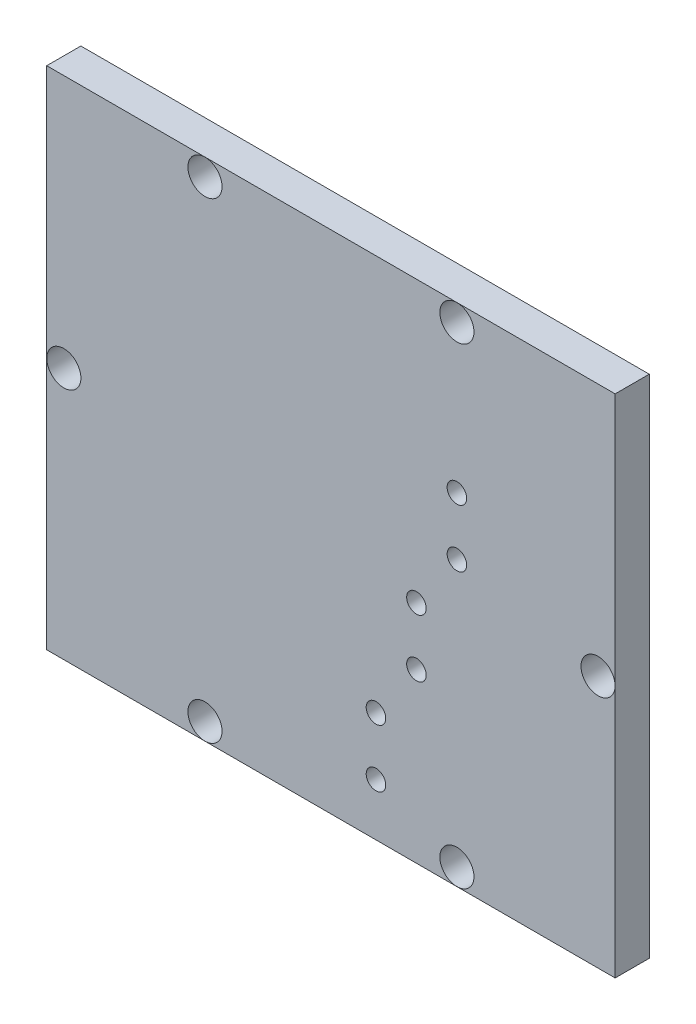
ISO-10303-21;
HEADER;
FILE_DESCRIPTION(('STEP AP214'),'2;1');
FILE_NAME('part.step','',(''),(''),'','','');
FILE_SCHEMA(('AUTOMOTIVE_DESIGN { 1 0 10303 214 1 1 1 1 }'));
ENDSEC;
DATA;
#1=APPLICATION_CONTEXT('core data for automotive mechanical design processes');
#2=APPLICATION_PROTOCOL_DEFINITION('international standard','automotive_design',2000,#1);
#3=PRODUCT_CONTEXT('',#1,'mechanical');
#4=PRODUCT('Part','Part','',(#3));
#5=PRODUCT_RELATED_PRODUCT_CATEGORY('part','',(#4));
#6=PRODUCT_DEFINITION_FORMATION('','',#4);
#7=PRODUCT_DEFINITION_CONTEXT('part definition',#1,'design');
#8=PRODUCT_DEFINITION('design','',#6,#7);
#9=PRODUCT_DEFINITION_SHAPE('','',#8);
#10=(LENGTH_UNIT() NAMED_UNIT(*) SI_UNIT(.MILLI.,.METRE.));
#11=(NAMED_UNIT(*) PLANE_ANGLE_UNIT() SI_UNIT($,.RADIAN.));
#12=(NAMED_UNIT(*) SI_UNIT($,.STERADIAN.) SOLID_ANGLE_UNIT());
#13=UNCERTAINTY_MEASURE_WITH_UNIT(LENGTH_MEASURE(1.E-05),#10,'distance_accuracy_value','');
#14=(GEOMETRIC_REPRESENTATION_CONTEXT(3) GLOBAL_UNCERTAINTY_ASSIGNED_CONTEXT((#13)) GLOBAL_UNIT_ASSIGNED_CONTEXT((#10,
#11,#12)) REPRESENTATION_CONTEXT('',''));
#15=CARTESIAN_POINT('',(0.,0.,0.));
#16=DIRECTION('',(0.,0.,1.));
#17=DIRECTION('',(1.,0.,0.));
#18=AXIS2_PLACEMENT_3D('',#15,#16,#17);
#19=CARTESIAN_POINT('',(158.75,0.,9.525));
#20=DIRECTION('',(0.,1.,0.));
#21=DIRECTION('',(-1.,0.,0.));
#22=AXIS2_PLACEMENT_3D('',#19,#20,#21);
#23=PLANE('',#22);
#24=DIRECTION('',(1.,0.,0.));
#25=VECTOR('',#24,1.);
#26=CARTESIAN_POINT('',(158.75,0.,0.));
#27=LINE('',#26,#25);
#28=CARTESIAN_POINT('',(0.,0.,0.));
#29=VERTEX_POINT('',#28);
#30=CARTESIAN_POINT('',(158.75,0.,0.));
#31=VERTEX_POINT('',#30);
#32=EDGE_CURVE('E95',#29,#31,#27,.T.);
#33=ORIENTED_EDGE('',*,*,#32,.T.);
#34=DIRECTION('',(0.,0.,-1.));
#35=VECTOR('',#34,1.);
#36=CARTESIAN_POINT('',(158.75,0.,9.525));
#37=LINE('',#36,#35);
#38=CARTESIAN_POINT('',(158.75,0.,9.525));
#39=VERTEX_POINT('',#38);
#40=EDGE_CURVE('E11',#39,#31,#37,.T.);
#41=ORIENTED_EDGE('',*,*,#40,.F.);
#42=DIRECTION('',(1.,0.,0.));
#43=VECTOR('',#42,1.);
#44=CARTESIAN_POINT('',(158.75,0.,9.525));
#45=LINE('',#44,#43);
#46=CARTESIAN_POINT('',(0.,0.,9.525));
#47=VERTEX_POINT('',#46);
#48=EDGE_CURVE('E83',#47,#39,#45,.T.);
#49=ORIENTED_EDGE('',*,*,#48,.F.);
#50=DIRECTION('',(0.,0.,-1.));
#51=VECTOR('',#50,1.);
#52=CARTESIAN_POINT('',(0.,0.,9.525));
#53=LINE('',#52,#51);
#54=EDGE_CURVE('E91',#47,#29,#53,.T.);
#55=ORIENTED_EDGE('',*,*,#54,.T.);
#56=EDGE_LOOP('',(#33,#41,#49,#55));
#57=FACE_BOUND('',#56,.T.);
#58=ADVANCED_FACE('F32',(#57),#23,.F.);
#59=CARTESIAN_POINT('',(158.75,141.2875,9.525));
#60=DIRECTION('',(-1.,0.,0.));
#61=DIRECTION('',(0.,0.,1.));
#62=AXIS2_PLACEMENT_3D('',#59,#60,#61);
#63=PLANE('',#62);
#64=DIRECTION('',(0.,1.,0.));
#65=VECTOR('',#64,1.);
#66=CARTESIAN_POINT('',(158.75,141.2875,0.));
#67=LINE('',#66,#65);
#68=CARTESIAN_POINT('',(158.75,141.2875,0.));
#69=VERTEX_POINT('',#68);
#70=EDGE_CURVE('E87',#31,#69,#67,.T.);
#71=ORIENTED_EDGE('',*,*,#70,.T.);
#72=DIRECTION('',(0.,0.,-1.));
#73=VECTOR('',#72,1.);
#74=CARTESIAN_POINT('',(158.75,141.2875,9.525));
#75=LINE('',#74,#73);
#76=CARTESIAN_POINT('',(158.75,141.2875,9.525));
#77=VERTEX_POINT('',#76);
#78=EDGE_CURVE('E40',#77,#69,#75,.T.);
#79=ORIENTED_EDGE('',*,*,#78,.F.);
#80=DIRECTION('',(0.,1.,0.));
#81=VECTOR('',#80,1.);
#82=CARTESIAN_POINT('',(158.75,141.2875,9.525));
#83=LINE('',#82,#81);
#84=EDGE_CURVE('E78',#39,#77,#83,.T.);
#85=ORIENTED_EDGE('',*,*,#84,.F.);
#86=ORIENTED_EDGE('',*,*,#40,.T.);
#87=EDGE_LOOP('',(#71,#79,#85,#86));
#88=FACE_BOUND('',#87,.T.);
#89=ADVANCED_FACE('F86',(#88),#63,.F.);
#90=CARTESIAN_POINT('',(0.,141.2875,9.525));
#91=DIRECTION('',(0.,-1.,0.));
#92=DIRECTION('',(0.,0.,-1.));
#93=AXIS2_PLACEMENT_3D('',#90,#91,#92);
#94=PLANE('',#93);
#95=DIRECTION('',(-1.,0.,0.));
#96=VECTOR('',#95,1.);
#97=CARTESIAN_POINT('',(0.,141.2875,0.));
#98=LINE('',#97,#96);
#99=CARTESIAN_POINT('',(0.,141.2875,0.));
#100=VERTEX_POINT('',#99);
#101=EDGE_CURVE('E65',#69,#100,#98,.T.);
#102=ORIENTED_EDGE('',*,*,#101,.T.);
#103=DIRECTION('',(0.,0.,-1.));
#104=VECTOR('',#103,1.);
#105=CARTESIAN_POINT('',(0.,141.2875,9.525));
#106=LINE('',#105,#104);
#107=CARTESIAN_POINT('',(0.,141.2875,9.525));
#108=VERTEX_POINT('',#107);
#109=EDGE_CURVE('E88',#108,#100,#106,.T.);
#110=ORIENTED_EDGE('',*,*,#109,.F.);
#111=DIRECTION('',(-1.,0.,0.));
#112=VECTOR('',#111,1.);
#113=CARTESIAN_POINT('',(0.,141.2875,9.525));
#114=LINE('',#113,#112);
#115=EDGE_CURVE('E81',#77,#108,#114,.T.);
#116=ORIENTED_EDGE('',*,*,#115,.F.);
#117=ORIENTED_EDGE('',*,*,#78,.T.);
#118=EDGE_LOOP('',(#102,#110,#116,#117));
#119=FACE_BOUND('',#118,.T.);
#120=ADVANCED_FACE('F89',(#119),#94,.F.);
#121=CARTESIAN_POINT('',(0.,0.,9.525));
#122=DIRECTION('',(1.,0.,0.));
#123=DIRECTION('',(0.,0.,-1.));
#124=AXIS2_PLACEMENT_3D('',#121,#122,#123);
#125=PLANE('',#124);
#126=DIRECTION('',(0.,-1.,0.));
#127=VECTOR('',#126,1.);
#128=CARTESIAN_POINT('',(0.,0.,0.));
#129=LINE('',#128,#127);
#130=EDGE_CURVE('E71',#100,#29,#129,.T.);
#131=ORIENTED_EDGE('',*,*,#130,.T.);
#132=ORIENTED_EDGE('',*,*,#54,.F.);
#133=DIRECTION('',(0.,-1.,0.));
#134=VECTOR('',#133,1.);
#135=CARTESIAN_POINT('',(0.,0.,9.525));
#136=LINE('',#135,#134);
#137=EDGE_CURVE('E48',#108,#47,#136,.T.);
#138=ORIENTED_EDGE('',*,*,#137,.F.);
#139=ORIENTED_EDGE('',*,*,#109,.T.);
#140=EDGE_LOOP('',(#131,#132,#138,#139));
#141=FACE_BOUND('',#140,.T.);
#142=ADVANCED_FACE('F103',(#141),#125,.F.);
#143=CARTESIAN_POINT('',(0.,0.,9.525));
#144=DIRECTION('',(0.,0.,-1.));
#145=DIRECTION('',(-1.,0.,0.));
#146=AXIS2_PLACEMENT_3D('',#143,#144,#145);
#147=PLANE('',#146);
#148=CARTESIAN_POINT('',(114.554,95.25,9.525));
#149=DIRECTION('',(0.,0.,1.));
#150=DIRECTION('',(1.,0.,0.));
#151=AXIS2_PLACEMENT_3D('',#148,#149,#150);
#152=CIRCLE('',#151,2.7305);
#153=CARTESIAN_POINT('',(117.2845,95.25,9.525));
#154=VERTEX_POINT('',#153);
#155=EDGE_CURVE('E175',#154,#154,#152,.T.);
#156=ORIENTED_EDGE('',*,*,#155,.F.);
#157=EDGE_LOOP('',(#156));
#158=FACE_BOUND('',#157,.T.);
#159=CARTESIAN_POINT('',(114.554,79.121,9.525));
#160=DIRECTION('',(0.,0.,1.));
#161=DIRECTION('',(1.,0.,0.));
#162=AXIS2_PLACEMENT_3D('',#159,#160,#161);
#163=CIRCLE('',#162,2.7305);
#164=CARTESIAN_POINT('',(117.2845,79.121,9.525));
#165=VERTEX_POINT('',#164);
#166=EDGE_CURVE('E169',#165,#165,#163,.T.);
#167=ORIENTED_EDGE('',*,*,#166,.F.);
#168=EDGE_LOOP('',(#167));
#169=FACE_BOUND('',#168,.T.);
#170=CARTESIAN_POINT('',(103.251,62.992,9.525));
#171=DIRECTION('',(0.,0.,1.));
#172=DIRECTION('',(1.,0.,0.));
#173=AXIS2_PLACEMENT_3D('',#170,#171,#172);
#174=CIRCLE('',#173,2.73050000000002);
#175=CARTESIAN_POINT('',(105.9815,62.992,9.525));
#176=VERTEX_POINT('',#175);
#177=EDGE_CURVE('E163',#176,#176,#174,.T.);
#178=ORIENTED_EDGE('',*,*,#177,.F.);
#179=EDGE_LOOP('',(#178));
#180=FACE_BOUND('',#179,.T.);
#181=CARTESIAN_POINT('',(103.251,46.863,9.525));
#182=DIRECTION('',(0.,0.,1.));
#183=DIRECTION('',(1.,0.,0.));
#184=AXIS2_PLACEMENT_3D('',#181,#182,#183);
#185=CIRCLE('',#184,2.7305);
#186=CARTESIAN_POINT('',(105.9815,46.863,9.525));
#187=VERTEX_POINT('',#186);
#188=EDGE_CURVE('E157',#187,#187,#185,.T.);
#189=ORIENTED_EDGE('',*,*,#188,.F.);
#190=EDGE_LOOP('',(#189));
#191=FACE_BOUND('',#190,.T.);
#192=CARTESIAN_POINT('',(91.948,30.734,9.525));
#193=DIRECTION('',(0.,0.,1.));
#194=DIRECTION('',(1.,0.,0.));
#195=AXIS2_PLACEMENT_3D('',#192,#193,#194);
#196=CIRCLE('',#195,2.7305);
#197=CARTESIAN_POINT('',(94.6785,30.734,9.525));
#198=VERTEX_POINT('',#197);
#199=EDGE_CURVE('E151',#198,#198,#196,.T.);
#200=ORIENTED_EDGE('',*,*,#199,.F.);
#201=EDGE_LOOP('',(#200));
#202=FACE_BOUND('',#201,.T.);
#203=CARTESIAN_POINT('',(91.948,14.605,9.525));
#204=DIRECTION('',(0.,0.,1.));
#205=DIRECTION('',(1.,0.,0.));
#206=AXIS2_PLACEMENT_3D('',#203,#204,#205);
#207=CIRCLE('',#206,2.7305);
#208=CARTESIAN_POINT('',(94.6785,14.605,9.525));
#209=VERTEX_POINT('',#208);
#210=EDGE_CURVE('E145',#209,#209,#207,.T.);
#211=ORIENTED_EDGE('',*,*,#210,.F.);
#212=EDGE_LOOP('',(#211));
#213=FACE_BOUND('',#212,.T.);
#214=CARTESIAN_POINT('',(114.554,4.7752,9.525));
#215=DIRECTION('',(0.,0.,1.));
#216=DIRECTION('',(1.,0.,0.));
#217=AXIS2_PLACEMENT_3D('',#214,#215,#216);
#218=CIRCLE('',#217,4.7625);
#219=CARTESIAN_POINT('',(119.3165,4.7752,9.525));
#220=VERTEX_POINT('',#219);
#221=EDGE_CURVE('E139',#220,#220,#218,.T.);
#222=ORIENTED_EDGE('',*,*,#221,.F.);
#223=EDGE_LOOP('',(#222));
#224=FACE_BOUND('',#223,.T.);
#225=CARTESIAN_POINT('',(44.196,4.7752,9.525));
#226=DIRECTION('',(0.,0.,1.));
#227=DIRECTION('',(1.,0.,0.));
#228=AXIS2_PLACEMENT_3D('',#225,#226,#227);
#229=CIRCLE('',#228,4.7625);
#230=CARTESIAN_POINT('',(48.9585,4.7752,9.525));
#231=VERTEX_POINT('',#230);
#232=EDGE_CURVE('E133',#231,#231,#229,.T.);
#233=ORIENTED_EDGE('',*,*,#232,.F.);
#234=EDGE_LOOP('',(#233));
#235=FACE_BOUND('',#234,.T.);
#236=CARTESIAN_POINT('',(114.554,136.5123,9.525));
#237=DIRECTION('',(0.,0.,1.));
#238=DIRECTION('',(1.,0.,0.));
#239=AXIS2_PLACEMENT_3D('',#236,#237,#238);
#240=CIRCLE('',#239,4.7625);
#241=CARTESIAN_POINT('',(119.3165,136.5123,9.525));
#242=VERTEX_POINT('',#241);
#243=EDGE_CURVE('E127',#242,#242,#240,.T.);
#244=ORIENTED_EDGE('',*,*,#243,.F.);
#245=EDGE_LOOP('',(#244));
#246=FACE_BOUND('',#245,.T.);
#247=CARTESIAN_POINT('',(44.196,136.5123,9.525));
#248=DIRECTION('',(0.,0.,1.));
#249=DIRECTION('',(1.,0.,0.));
#250=AXIS2_PLACEMENT_3D('',#247,#248,#249);
#251=CIRCLE('',#250,4.7625);
#252=CARTESIAN_POINT('',(48.9585,136.5123,9.525));
#253=VERTEX_POINT('',#252);
#254=EDGE_CURVE('E121',#253,#253,#251,.T.);
#255=ORIENTED_EDGE('',*,*,#254,.F.);
#256=EDGE_LOOP('',(#255));
#257=FACE_BOUND('',#256,.T.);
#258=CARTESIAN_POINT('',(153.9748,70.64375,9.525));
#259=DIRECTION('',(0.,0.,1.));
#260=DIRECTION('',(1.,0.,0.));
#261=AXIS2_PLACEMENT_3D('',#258,#259,#260);
#262=CIRCLE('',#261,4.76250000000001);
#263=CARTESIAN_POINT('',(158.7373,70.64375,9.525));
#264=VERTEX_POINT('',#263);
#265=EDGE_CURVE('E115',#264,#264,#262,.T.);
#266=ORIENTED_EDGE('',*,*,#265,.F.);
#267=EDGE_LOOP('',(#266));
#268=FACE_BOUND('',#267,.T.);
#269=CARTESIAN_POINT('',(4.7752,70.5036045316736,9.525));
#270=DIRECTION('',(0.,0.,1.));
#271=DIRECTION('',(1.,0.,0.));
#272=AXIS2_PLACEMENT_3D('',#269,#270,#271);
#273=CIRCLE('',#272,4.7625);
#274=CARTESIAN_POINT('',(9.5377,70.5036045316736,9.525));
#275=VERTEX_POINT('',#274);
#276=EDGE_CURVE('E109',#275,#275,#273,.T.);
#277=ORIENTED_EDGE('',*,*,#276,.F.);
#278=EDGE_LOOP('',(#277));
#279=FACE_BOUND('',#278,.T.);
#280=ORIENTED_EDGE('',*,*,#48,.T.);
#281=ORIENTED_EDGE('',*,*,#84,.T.);
#282=ORIENTED_EDGE('',*,*,#115,.T.);
#283=ORIENTED_EDGE('',*,*,#137,.T.);
#284=EDGE_LOOP('',(#280,#281,#282,#283));
#285=FACE_BOUND('',#284,.T.);
#286=ADVANCED_FACE('F79',(#158,#169,#180,#191,#202,#213,#224,#235,#246,#257,#268,#279,#285),
#147,.F.);
#287=CARTESIAN_POINT('',(0.,0.,0.));
#288=DIRECTION('',(0.,0.,-1.));
#289=DIRECTION('',(-1.,0.,0.));
#290=AXIS2_PLACEMENT_3D('',#287,#288,#289);
#291=PLANE('',#290);
#292=CARTESIAN_POINT('',(114.554,95.25,0.));
#293=DIRECTION('',(0.,0.,1.));
#294=DIRECTION('',(1.,0.,0.));
#295=AXIS2_PLACEMENT_3D('',#292,#293,#294);
#296=CIRCLE('',#295,2.7305);
#297=CARTESIAN_POINT('',(117.2845,95.25,0.));
#298=VERTEX_POINT('',#297);
#299=EDGE_CURVE('E172',#298,#298,#296,.T.);
#300=ORIENTED_EDGE('',*,*,#299,.T.);
#301=EDGE_LOOP('',(#300));
#302=FACE_BOUND('',#301,.T.);
#303=CARTESIAN_POINT('',(114.554,79.121,0.));
#304=DIRECTION('',(0.,0.,1.));
#305=DIRECTION('',(1.,0.,0.));
#306=AXIS2_PLACEMENT_3D('',#303,#304,#305);
#307=CIRCLE('',#306,2.7305);
#308=CARTESIAN_POINT('',(117.2845,79.121,0.));
#309=VERTEX_POINT('',#308);
#310=EDGE_CURVE('E166',#309,#309,#307,.T.);
#311=ORIENTED_EDGE('',*,*,#310,.T.);
#312=EDGE_LOOP('',(#311));
#313=FACE_BOUND('',#312,.T.);
#314=CARTESIAN_POINT('',(103.251,62.992,0.));
#315=DIRECTION('',(0.,0.,1.));
#316=DIRECTION('',(1.,0.,0.));
#317=AXIS2_PLACEMENT_3D('',#314,#315,#316);
#318=CIRCLE('',#317,2.73050000000002);
#319=CARTESIAN_POINT('',(105.9815,62.992,0.));
#320=VERTEX_POINT('',#319);
#321=EDGE_CURVE('E160',#320,#320,#318,.T.);
#322=ORIENTED_EDGE('',*,*,#321,.T.);
#323=EDGE_LOOP('',(#322));
#324=FACE_BOUND('',#323,.T.);
#325=CARTESIAN_POINT('',(103.251,46.863,0.));
#326=DIRECTION('',(0.,0.,1.));
#327=DIRECTION('',(1.,0.,0.));
#328=AXIS2_PLACEMENT_3D('',#325,#326,#327);
#329=CIRCLE('',#328,2.7305);
#330=CARTESIAN_POINT('',(105.9815,46.863,0.));
#331=VERTEX_POINT('',#330);
#332=EDGE_CURVE('E154',#331,#331,#329,.T.);
#333=ORIENTED_EDGE('',*,*,#332,.T.);
#334=EDGE_LOOP('',(#333));
#335=FACE_BOUND('',#334,.T.);
#336=CARTESIAN_POINT('',(91.948,30.734,0.));
#337=DIRECTION('',(0.,0.,1.));
#338=DIRECTION('',(1.,0.,0.));
#339=AXIS2_PLACEMENT_3D('',#336,#337,#338);
#340=CIRCLE('',#339,2.7305);
#341=CARTESIAN_POINT('',(94.6785,30.734,0.));
#342=VERTEX_POINT('',#341);
#343=EDGE_CURVE('E148',#342,#342,#340,.T.);
#344=ORIENTED_EDGE('',*,*,#343,.T.);
#345=EDGE_LOOP('',(#344));
#346=FACE_BOUND('',#345,.T.);
#347=CARTESIAN_POINT('',(91.948,14.605,0.));
#348=DIRECTION('',(0.,0.,1.));
#349=DIRECTION('',(1.,0.,0.));
#350=AXIS2_PLACEMENT_3D('',#347,#348,#349);
#351=CIRCLE('',#350,2.7305);
#352=CARTESIAN_POINT('',(94.6785,14.605,0.));
#353=VERTEX_POINT('',#352);
#354=EDGE_CURVE('E142',#353,#353,#351,.T.);
#355=ORIENTED_EDGE('',*,*,#354,.T.);
#356=EDGE_LOOP('',(#355));
#357=FACE_BOUND('',#356,.T.);
#358=CARTESIAN_POINT('',(114.554,4.7752,0.));
#359=DIRECTION('',(0.,0.,1.));
#360=DIRECTION('',(1.,0.,0.));
#361=AXIS2_PLACEMENT_3D('',#358,#359,#360);
#362=CIRCLE('',#361,4.7625);
#363=CARTESIAN_POINT('',(119.3165,4.7752,0.));
#364=VERTEX_POINT('',#363);
#365=EDGE_CURVE('E136',#364,#364,#362,.T.);
#366=ORIENTED_EDGE('',*,*,#365,.T.);
#367=EDGE_LOOP('',(#366));
#368=FACE_BOUND('',#367,.T.);
#369=CARTESIAN_POINT('',(44.196,4.7752,0.));
#370=DIRECTION('',(0.,0.,1.));
#371=DIRECTION('',(1.,0.,0.));
#372=AXIS2_PLACEMENT_3D('',#369,#370,#371);
#373=CIRCLE('',#372,4.7625);
#374=CARTESIAN_POINT('',(48.9585,4.7752,0.));
#375=VERTEX_POINT('',#374);
#376=EDGE_CURVE('E130',#375,#375,#373,.T.);
#377=ORIENTED_EDGE('',*,*,#376,.T.);
#378=EDGE_LOOP('',(#377));
#379=FACE_BOUND('',#378,.T.);
#380=CARTESIAN_POINT('',(114.554,136.5123,0.));
#381=DIRECTION('',(0.,0.,1.));
#382=DIRECTION('',(1.,0.,0.));
#383=AXIS2_PLACEMENT_3D('',#380,#381,#382);
#384=CIRCLE('',#383,4.7625);
#385=CARTESIAN_POINT('',(119.3165,136.5123,0.));
#386=VERTEX_POINT('',#385);
#387=EDGE_CURVE('E124',#386,#386,#384,.T.);
#388=ORIENTED_EDGE('',*,*,#387,.T.);
#389=EDGE_LOOP('',(#388));
#390=FACE_BOUND('',#389,.T.);
#391=CARTESIAN_POINT('',(44.196,136.5123,0.));
#392=DIRECTION('',(0.,0.,1.));
#393=DIRECTION('',(1.,0.,0.));
#394=AXIS2_PLACEMENT_3D('',#391,#392,#393);
#395=CIRCLE('',#394,4.7625);
#396=CARTESIAN_POINT('',(48.9585,136.5123,0.));
#397=VERTEX_POINT('',#396);
#398=EDGE_CURVE('E118',#397,#397,#395,.T.);
#399=ORIENTED_EDGE('',*,*,#398,.T.);
#400=EDGE_LOOP('',(#399));
#401=FACE_BOUND('',#400,.T.);
#402=CARTESIAN_POINT('',(153.9748,70.64375,0.));
#403=DIRECTION('',(0.,0.,1.));
#404=DIRECTION('',(1.,0.,0.));
#405=AXIS2_PLACEMENT_3D('',#402,#403,#404);
#406=CIRCLE('',#405,4.76250000000001);
#407=CARTESIAN_POINT('',(158.7373,70.64375,0.));
#408=VERTEX_POINT('',#407);
#409=EDGE_CURVE('E112',#408,#408,#406,.T.);
#410=ORIENTED_EDGE('',*,*,#409,.T.);
#411=EDGE_LOOP('',(#410));
#412=FACE_BOUND('',#411,.T.);
#413=CARTESIAN_POINT('',(4.7752,70.5036045316736,0.));
#414=DIRECTION('',(0.,0.,1.));
#415=DIRECTION('',(1.,0.,0.));
#416=AXIS2_PLACEMENT_3D('',#413,#414,#415);
#417=CIRCLE('',#416,4.7625);
#418=CARTESIAN_POINT('',(9.5377,70.5036045316736,0.));
#419=VERTEX_POINT('',#418);
#420=EDGE_CURVE('E98',#419,#419,#417,.T.);
#421=ORIENTED_EDGE('',*,*,#420,.T.);
#422=EDGE_LOOP('',(#421));
#423=FACE_BOUND('',#422,.T.);
#424=ORIENTED_EDGE('',*,*,#32,.F.);
#425=ORIENTED_EDGE('',*,*,#130,.F.);
#426=ORIENTED_EDGE('',*,*,#101,.F.);
#427=ORIENTED_EDGE('',*,*,#70,.F.);
#428=EDGE_LOOP('',(#424,#425,#426,#427));
#429=FACE_BOUND('',#428,.T.);
#430=ADVANCED_FACE('F106',(#302,#313,#324,#335,#346,#357,#368,#379,#390,#401,#412,#423,#429),
#291,.T.);
#431=CARTESIAN_POINT('',(4.7752,70.5036045316736,0.));
#432=DIRECTION('',(0.,0.,1.));
#433=DIRECTION('',(1.,0.,0.));
#434=AXIS2_PLACEMENT_3D('',#431,#432,#433);
#435=CYLINDRICAL_SURFACE('',#434,4.7625);
#436=ORIENTED_EDGE('',*,*,#420,.F.);
#437=EDGE_LOOP('',(#436));
#438=FACE_BOUND('',#437,.T.);
#439=ORIENTED_EDGE('',*,*,#276,.T.);
#440=EDGE_LOOP('',(#439));
#441=FACE_BOUND('',#440,.T.);
#442=ADVANCED_FACE('F215',(#438,#441),#435,.F.);
#443=CARTESIAN_POINT('',(153.9748,70.64375,0.));
#444=DIRECTION('',(0.,0.,1.));
#445=DIRECTION('',(1.,0.,0.));
#446=AXIS2_PLACEMENT_3D('',#443,#444,#445);
#447=CYLINDRICAL_SURFACE('',#446,4.76250000000001);
#448=ORIENTED_EDGE('',*,*,#409,.F.);
#449=EDGE_LOOP('',(#448));
#450=FACE_BOUND('',#449,.T.);
#451=ORIENTED_EDGE('',*,*,#265,.T.);
#452=EDGE_LOOP('',(#451));
#453=FACE_BOUND('',#452,.T.);
#454=ADVANCED_FACE('F217',(#450,#453),#447,.F.);
#455=CARTESIAN_POINT('',(44.196,136.5123,0.));
#456=DIRECTION('',(0.,0.,1.));
#457=DIRECTION('',(1.,0.,0.));
#458=AXIS2_PLACEMENT_3D('',#455,#456,#457);
#459=CYLINDRICAL_SURFACE('',#458,4.7625);
#460=ORIENTED_EDGE('',*,*,#398,.F.);
#461=EDGE_LOOP('',(#460));
#462=FACE_BOUND('',#461,.T.);
#463=ORIENTED_EDGE('',*,*,#254,.T.);
#464=EDGE_LOOP('',(#463));
#465=FACE_BOUND('',#464,.T.);
#466=ADVANCED_FACE('F224',(#462,#465),#459,.F.);
#467=CARTESIAN_POINT('',(114.554,136.5123,0.));
#468=DIRECTION('',(0.,0.,1.));
#469=DIRECTION('',(1.,0.,0.));
#470=AXIS2_PLACEMENT_3D('',#467,#468,#469);
#471=CYLINDRICAL_SURFACE('',#470,4.7625);
#472=ORIENTED_EDGE('',*,*,#387,.F.);
#473=EDGE_LOOP('',(#472));
#474=FACE_BOUND('',#473,.T.);
#475=ORIENTED_EDGE('',*,*,#243,.T.);
#476=EDGE_LOOP('',(#475));
#477=FACE_BOUND('',#476,.T.);
#478=ADVANCED_FACE('F270',(#474,#477),#471,.F.);
#479=CARTESIAN_POINT('',(44.196,4.7752,0.));
#480=DIRECTION('',(0.,0.,1.));
#481=DIRECTION('',(1.,0.,0.));
#482=AXIS2_PLACEMENT_3D('',#479,#480,#481);
#483=CYLINDRICAL_SURFACE('',#482,4.7625);
#484=ORIENTED_EDGE('',*,*,#376,.F.);
#485=EDGE_LOOP('',(#484));
#486=FACE_BOUND('',#485,.T.);
#487=ORIENTED_EDGE('',*,*,#232,.T.);
#488=EDGE_LOOP('',(#487));
#489=FACE_BOUND('',#488,.T.);
#490=ADVANCED_FACE('F280',(#486,#489),#483,.F.);
#491=CARTESIAN_POINT('',(114.554,4.7752,0.));
#492=DIRECTION('',(0.,0.,1.));
#493=DIRECTION('',(1.,0.,0.));
#494=AXIS2_PLACEMENT_3D('',#491,#492,#493);
#495=CYLINDRICAL_SURFACE('',#494,4.7625);
#496=ORIENTED_EDGE('',*,*,#365,.F.);
#497=EDGE_LOOP('',(#496));
#498=FACE_BOUND('',#497,.T.);
#499=ORIENTED_EDGE('',*,*,#221,.T.);
#500=EDGE_LOOP('',(#499));
#501=FACE_BOUND('',#500,.T.);
#502=ADVANCED_FACE('F290',(#498,#501),#495,.F.);
#503=CARTESIAN_POINT('',(91.948,14.605,0.));
#504=DIRECTION('',(0.,0.,1.));
#505=DIRECTION('',(1.,0.,0.));
#506=AXIS2_PLACEMENT_3D('',#503,#504,#505);
#507=CYLINDRICAL_SURFACE('',#506,2.7305);
#508=ORIENTED_EDGE('',*,*,#354,.F.);
#509=EDGE_LOOP('',(#508));
#510=FACE_BOUND('',#509,.T.);
#511=ORIENTED_EDGE('',*,*,#210,.T.);
#512=EDGE_LOOP('',(#511));
#513=FACE_BOUND('',#512,.T.);
#514=ADVANCED_FACE('F300',(#510,#513),#507,.F.);
#515=CARTESIAN_POINT('',(91.948,30.734,0.));
#516=DIRECTION('',(0.,0.,1.));
#517=DIRECTION('',(1.,0.,0.));
#518=AXIS2_PLACEMENT_3D('',#515,#516,#517);
#519=CYLINDRICAL_SURFACE('',#518,2.7305);
#520=ORIENTED_EDGE('',*,*,#343,.F.);
#521=EDGE_LOOP('',(#520));
#522=FACE_BOUND('',#521,.T.);
#523=ORIENTED_EDGE('',*,*,#199,.T.);
#524=EDGE_LOOP('',(#523));
#525=FACE_BOUND('',#524,.T.);
#526=ADVANCED_FACE('F310',(#522,#525),#519,.F.);
#527=CARTESIAN_POINT('',(103.251,46.863,0.));
#528=DIRECTION('',(0.,0.,1.));
#529=DIRECTION('',(1.,0.,0.));
#530=AXIS2_PLACEMENT_3D('',#527,#528,#529);
#531=CYLINDRICAL_SURFACE('',#530,2.7305);
#532=ORIENTED_EDGE('',*,*,#332,.F.);
#533=EDGE_LOOP('',(#532));
#534=FACE_BOUND('',#533,.T.);
#535=ORIENTED_EDGE('',*,*,#188,.T.);
#536=EDGE_LOOP('',(#535));
#537=FACE_BOUND('',#536,.T.);
#538=ADVANCED_FACE('F320',(#534,#537),#531,.F.);
#539=CARTESIAN_POINT('',(103.251,62.992,0.));
#540=DIRECTION('',(0.,0.,1.));
#541=DIRECTION('',(1.,0.,0.));
#542=AXIS2_PLACEMENT_3D('',#539,#540,#541);
#543=CYLINDRICAL_SURFACE('',#542,2.73050000000002);
#544=ORIENTED_EDGE('',*,*,#321,.F.);
#545=EDGE_LOOP('',(#544));
#546=FACE_BOUND('',#545,.T.);
#547=ORIENTED_EDGE('',*,*,#177,.T.);
#548=EDGE_LOOP('',(#547));
#549=FACE_BOUND('',#548,.T.);
#550=ADVANCED_FACE('F330',(#546,#549),#543,.F.);
#551=CARTESIAN_POINT('',(114.554,79.121,0.));
#552=DIRECTION('',(0.,0.,1.));
#553=DIRECTION('',(1.,0.,0.));
#554=AXIS2_PLACEMENT_3D('',#551,#552,#553);
#555=CYLINDRICAL_SURFACE('',#554,2.7305);
#556=ORIENTED_EDGE('',*,*,#310,.F.);
#557=EDGE_LOOP('',(#556));
#558=FACE_BOUND('',#557,.T.);
#559=ORIENTED_EDGE('',*,*,#166,.T.);
#560=EDGE_LOOP('',(#559));
#561=FACE_BOUND('',#560,.T.);
#562=ADVANCED_FACE('F186',(#558,#561),#555,.F.);
#563=CARTESIAN_POINT('',(114.554,95.25,0.));
#564=DIRECTION('',(0.,0.,1.));
#565=DIRECTION('',(1.,0.,0.));
#566=AXIS2_PLACEMENT_3D('',#563,#564,#565);
#567=CYLINDRICAL_SURFACE('',#566,2.7305);
#568=ORIENTED_EDGE('',*,*,#299,.F.);
#569=EDGE_LOOP('',(#568));
#570=FACE_BOUND('',#569,.T.);
#571=ORIENTED_EDGE('',*,*,#155,.T.);
#572=EDGE_LOOP('',(#571));
#573=FACE_BOUND('',#572,.T.);
#574=ADVANCED_FACE('F183',(#570,#573),#567,.F.);
#575=CLOSED_SHELL('',(#58,#89,#120,#142,#286,#430,#442,#454,#466,#478,#490,#502,#514,#526,#538,
#550,#562,#574));
#576=MANIFOLD_SOLID_BREP('B2',#575);
#577=ADVANCED_BREP_SHAPE_REPRESENTATION('',(#18,#576),#14);
#578=SHAPE_DEFINITION_REPRESENTATION(#9,#577);
ENDSEC;
END-ISO-10303-21;
